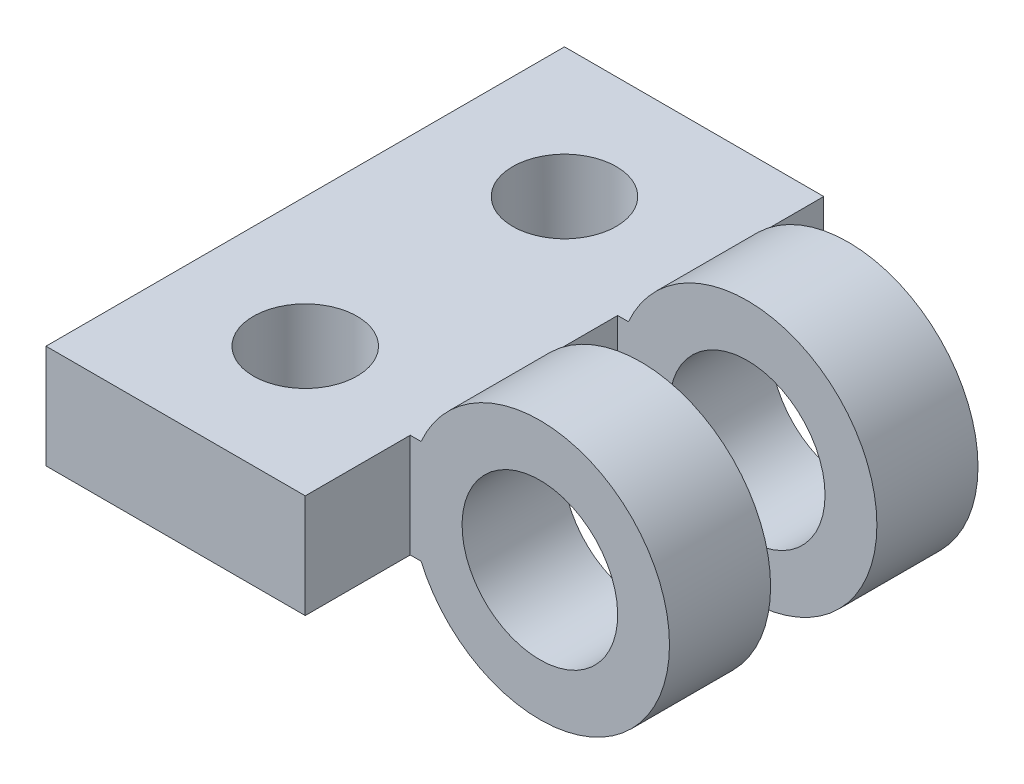
ISO-10303-21;
HEADER;
FILE_DESCRIPTION(('STEP AP214'),'2;1');
FILE_NAME('part.step','',(''),(''),'','','');
FILE_SCHEMA(('AUTOMOTIVE_DESIGN { 1 0 10303 214 1 1 1 1 }'));
ENDSEC;
DATA;
#1=APPLICATION_CONTEXT('core data for automotive mechanical design processes');
#2=APPLICATION_PROTOCOL_DEFINITION('international standard','automotive_design',2000,#1);
#3=PRODUCT_CONTEXT('',#1,'mechanical');
#4=PRODUCT('Part','Part','',(#3));
#5=PRODUCT_RELATED_PRODUCT_CATEGORY('part','',(#4));
#6=PRODUCT_DEFINITION_FORMATION('','',#4);
#7=PRODUCT_DEFINITION_CONTEXT('part definition',#1,'design');
#8=PRODUCT_DEFINITION('design','',#6,#7);
#9=PRODUCT_DEFINITION_SHAPE('','',#8);
#10=(LENGTH_UNIT() NAMED_UNIT(*) SI_UNIT(.MILLI.,.METRE.));
#11=(NAMED_UNIT(*) PLANE_ANGLE_UNIT() SI_UNIT($,.RADIAN.));
#12=(NAMED_UNIT(*) SI_UNIT($,.STERADIAN.) SOLID_ANGLE_UNIT());
#13=UNCERTAINTY_MEASURE_WITH_UNIT(LENGTH_MEASURE(1.E-05),#10,'distance_accuracy_value','');
#14=(GEOMETRIC_REPRESENTATION_CONTEXT(3) GLOBAL_UNCERTAINTY_ASSIGNED_CONTEXT((#13)) GLOBAL_UNIT_ASSIGNED_CONTEXT((#10,
#11,#12)) REPRESENTATION_CONTEXT('',''));
#15=CARTESIAN_POINT('',(0.,0.,0.));
#16=DIRECTION('',(0.,0.,1.));
#17=DIRECTION('',(1.,0.,0.));
#18=AXIS2_PLACEMENT_3D('',#15,#16,#17);
#19=CARTESIAN_POINT('',(-2.5,-1.,-2.025));
#20=DIRECTION('',(1.,0.,0.));
#21=DIRECTION('',(0.,0.,-1.));
#22=AXIS2_PLACEMENT_3D('',#19,#20,#21);
#23=PLANE('',#22);
#24=DIRECTION('',(0.,0.,-1.));
#25=VECTOR('',#24,1.);
#26=CARTESIAN_POINT('',(-2.5,1.,-2.025));
#27=LINE('',#26,#25);
#28=CARTESIAN_POINT('',(-2.5,1.,0.));
#29=VERTEX_POINT('',#28);
#30=CARTESIAN_POINT('',(-2.5,1.,-2.025));
#31=VERTEX_POINT('',#30);
#32=EDGE_CURVE('E251',#29,#31,#27,.T.);
#33=ORIENTED_EDGE('',*,*,#32,.F.);
#34=DIRECTION('',(0.,1.,0.));
#35=VECTOR('',#34,1.);
#36=CARTESIAN_POINT('',(-2.5,1.,0.));
#37=LINE('',#36,#35);
#38=CARTESIAN_POINT('',(-2.5,-1.,0.));
#39=VERTEX_POINT('',#38);
#40=EDGE_CURVE('E58',#39,#29,#37,.T.);
#41=ORIENTED_EDGE('',*,*,#40,.F.);
#42=DIRECTION('',(0.,0.,-1.));
#43=VECTOR('',#42,1.);
#44=CARTESIAN_POINT('',(-2.5,-1.,-2.025));
#45=LINE('',#44,#43);
#46=CARTESIAN_POINT('',(-2.5,-1.,-2.025));
#47=VERTEX_POINT('',#46);
#48=EDGE_CURVE('E282',#39,#47,#45,.T.);
#49=ORIENTED_EDGE('',*,*,#48,.T.);
#50=DIRECTION('',(0.,1.,0.));
#51=VECTOR('',#50,1.);
#52=CARTESIAN_POINT('',(-2.5,-1.,-2.025));
#53=LINE('',#52,#51);
#54=EDGE_CURVE('E172',#47,#31,#53,.T.);
#55=ORIENTED_EDGE('',*,*,#54,.T.);
#56=EDGE_LOOP('',(#33,#41,#49,#55));
#57=FACE_BOUND('',#56,.T.);
#58=ADVANCED_FACE('F42',(#57),#23,.T.);
#59=DIRECTION('',(0.,-1.,0.));
#60=VECTOR('',#59,1.);
#61=CARTESIAN_POINT('',(-2.5,1.,1.95));
#62=LINE('',#61,#60);
#63=CARTESIAN_POINT('',(-2.5,1.,1.95));
#64=VERTEX_POINT('',#63);
#65=CARTESIAN_POINT('',(-2.5,-1.,1.95));
#66=VERTEX_POINT('',#65);
#67=EDGE_CURVE('E160',#64,#66,#62,.T.);
#68=ORIENTED_EDGE('',*,*,#67,.F.);
#69=CARTESIAN_POINT('',(-2.5,1.,4.));
#70=VERTEX_POINT('',#69);
#71=EDGE_CURVE('E141',#70,#64,#27,.T.);
#72=ORIENTED_EDGE('',*,*,#71,.F.);
#73=DIRECTION('',(0.,1.,0.));
#74=VECTOR('',#73,1.);
#75=CARTESIAN_POINT('',(-2.5,1.,4.));
#76=LINE('',#75,#74);
#77=CARTESIAN_POINT('',(-2.5,-1.,4.));
#78=VERTEX_POINT('',#77);
#79=EDGE_CURVE('E66',#78,#70,#76,.T.);
#80=ORIENTED_EDGE('',*,*,#79,.F.);
#81=EDGE_CURVE('E280',#78,#66,#45,.T.);
#82=ORIENTED_EDGE('',*,*,#81,.T.);
#83=EDGE_LOOP('',(#68,#72,#80,#82));
#84=FACE_BOUND('',#83,.T.);
#85=ADVANCED_FACE('F204',(#84),#23,.T.);
#86=CARTESIAN_POINT('',(0.,0.,1.95));
#87=DIRECTION('',(0.,0.,-1.));
#88=DIRECTION('',(-1.,0.,0.));
#89=AXIS2_PLACEMENT_3D('',#86,#87,#88);
#90=CYLINDRICAL_SURFACE('',#89,2.5);
#91=DIRECTION('',(0.,0.,1.));
#92=VECTOR('',#91,1.);
#93=CARTESIAN_POINT('',(-2.29128784747792,1.,4.));
#94=LINE('',#93,#92);
#95=CARTESIAN_POINT('',(-2.29128784747792,1.,1.95));
#96=VERTEX_POINT('',#95);
#97=CARTESIAN_POINT('',(-2.29128784747792,1.,0.));
#98=VERTEX_POINT('',#97);
#99=EDGE_CURVE('E138',#96,#98,#94,.F.);
#100=ORIENTED_EDGE('',*,*,#99,.F.);
#101=CARTESIAN_POINT('',(0.,0.,1.95));
#102=DIRECTION('',(0.,0.,1.));
#103=DIRECTION('',(1.,0.,0.));
#104=AXIS2_PLACEMENT_3D('',#101,#102,#103);
#105=CIRCLE('',#104,2.5);
#106=CARTESIAN_POINT('',(-2.29128784747792,-1.,1.95));
#107=VERTEX_POINT('',#106);
#108=EDGE_CURVE('E11',#107,#96,#105,.T.);
#109=ORIENTED_EDGE('',*,*,#108,.F.);
#110=DIRECTION('',(0.,0.,1.));
#111=VECTOR('',#110,1.);
#112=CARTESIAN_POINT('',(-2.29128784747792,-1.,4.));
#113=LINE('',#112,#111);
#114=CARTESIAN_POINT('',(-2.29128784747792,-1.,0.));
#115=VERTEX_POINT('',#114);
#116=EDGE_CURVE('E164',#115,#107,#113,.T.);
#117=ORIENTED_EDGE('',*,*,#116,.F.);
#118=CARTESIAN_POINT('',(0.,0.,0.));
#119=DIRECTION('',(0.,0.,1.));
#120=DIRECTION('',(1.,0.,0.));
#121=AXIS2_PLACEMENT_3D('',#118,#119,#120);
#122=CIRCLE('',#121,2.5);
#123=EDGE_CURVE('E46',#115,#98,#122,.T.);
#124=ORIENTED_EDGE('',*,*,#123,.T.);
#125=EDGE_LOOP('',(#100,#109,#117,#124));
#126=FACE_BOUND('',#125,.T.);
#127=ADVANCED_FACE('F44',(#126),#90,.T.);
#128=DIRECTION('',(0.,-1.,0.));
#129=VECTOR('',#128,1.);
#130=CARTESIAN_POINT('',(-2.5,1.,5.95));
#131=LINE('',#130,#129);
#132=CARTESIAN_POINT('',(-2.5,1.,5.95));
#133=VERTEX_POINT('',#132);
#134=CARTESIAN_POINT('',(-2.5,-1.,5.95));
#135=VERTEX_POINT('',#134);
#136=EDGE_CURVE('E224',#133,#135,#131,.T.);
#137=ORIENTED_EDGE('',*,*,#136,.F.);
#138=CARTESIAN_POINT('',(-2.5,1.,7.975));
#139=VERTEX_POINT('',#138);
#140=EDGE_CURVE('E226',#139,#133,#27,.T.);
#141=ORIENTED_EDGE('',*,*,#140,.F.);
#142=DIRECTION('',(0.,1.,0.));
#143=VECTOR('',#142,1.);
#144=CARTESIAN_POINT('',(-2.5,-1.,7.975));
#145=LINE('',#144,#143);
#146=CARTESIAN_POINT('',(-2.5,-1.,7.975));
#147=VERTEX_POINT('',#146);
#148=EDGE_CURVE('E169',#147,#139,#145,.T.);
#149=ORIENTED_EDGE('',*,*,#148,.F.);
#150=EDGE_CURVE('E228',#147,#135,#45,.T.);
#151=ORIENTED_EDGE('',*,*,#150,.T.);
#152=EDGE_LOOP('',(#137,#141,#149,#151));
#153=FACE_BOUND('',#152,.T.);
#154=ADVANCED_FACE('F207',(#153),#23,.T.);
#155=CARTESIAN_POINT('',(0.,0.,4.));
#156=DIRECTION('',(0.,0.,1.));
#157=DIRECTION('',(0.,-1.,0.));
#158=AXIS2_PLACEMENT_3D('',#155,#156,#157);
#159=CYLINDRICAL_SURFACE('',#158,2.5);
#160=CARTESIAN_POINT('',(0.,0.,4.));
#161=DIRECTION('',(0.,0.,1.));
#162=DIRECTION('',(0.,-1.,0.));
#163=AXIS2_PLACEMENT_3D('',#160,#161,#162);
#164=CIRCLE('',#163,2.5);
#165=CARTESIAN_POINT('',(-2.29128784747792,-1.,4.));
#166=VERTEX_POINT('',#165);
#167=CARTESIAN_POINT('',(-2.29128784747792,1.,4.));
#168=VERTEX_POINT('',#167);
#169=EDGE_CURVE('E233',#166,#168,#164,.T.);
#170=ORIENTED_EDGE('',*,*,#169,.T.);
#171=DIRECTION('',(0.,0.,1.));
#172=VECTOR('',#171,1.);
#173=CARTESIAN_POINT('',(-2.29128784747792,1.,4.));
#174=LINE('',#173,#172);
#175=CARTESIAN_POINT('',(-2.29128784747792,0.999999999999999,5.95));
#176=VERTEX_POINT('',#175);
#177=EDGE_CURVE('E327',#176,#168,#174,.F.);
#178=ORIENTED_EDGE('',*,*,#177,.F.);
#179=CARTESIAN_POINT('',(0.,0.,5.95));
#180=DIRECTION('',(0.,0.,1.));
#181=DIRECTION('',(0.,-1.,0.));
#182=AXIS2_PLACEMENT_3D('',#179,#180,#181);
#183=CIRCLE('',#182,2.5);
#184=CARTESIAN_POINT('',(-2.29128784747792,-1.,5.95));
#185=VERTEX_POINT('',#184);
#186=EDGE_CURVE('E238',#185,#176,#183,.T.);
#187=ORIENTED_EDGE('',*,*,#186,.F.);
#188=DIRECTION('',(0.,0.,1.));
#189=VECTOR('',#188,1.);
#190=CARTESIAN_POINT('',(-2.29128784747792,-1.,4.));
#191=LINE('',#190,#189);
#192=EDGE_CURVE('E259',#166,#185,#191,.T.);
#193=ORIENTED_EDGE('',*,*,#192,.F.);
#194=EDGE_LOOP('',(#170,#178,#187,#193));
#195=FACE_BOUND('',#194,.T.);
#196=ADVANCED_FACE('F214',(#195),#159,.T.);
#197=CARTESIAN_POINT('',(0.,0.,1.95));
#198=DIRECTION('',(0.,0.,1.));
#199=DIRECTION('',(1.,0.,0.));
#200=AXIS2_PLACEMENT_3D('',#197,#198,#199);
#201=PLANE('',#200);
#202=ORIENTED_EDGE('',*,*,#108,.T.);
#203=DIRECTION('',(-1.,0.,0.));
#204=VECTOR('',#203,1.);
#205=CARTESIAN_POINT('',(2.501,1.,1.95));
#206=LINE('',#205,#204);
#207=EDGE_CURVE('E134',#96,#64,#206,.T.);
#208=ORIENTED_EDGE('',*,*,#207,.T.);
#209=ORIENTED_EDGE('',*,*,#67,.T.);
#210=DIRECTION('',(-1.,0.,0.));
#211=VECTOR('',#210,1.);
#212=CARTESIAN_POINT('',(2.501,-1.,1.95));
#213=LINE('',#212,#211);
#214=EDGE_CURVE('E159',#107,#66,#213,.T.);
#215=ORIENTED_EDGE('',*,*,#214,.F.);
#216=EDGE_LOOP('',(#202,#208,#209,#215));
#217=FACE_BOUND('',#216,.T.);
#218=CARTESIAN_POINT('',(0.,0.,1.95));
#219=DIRECTION('',(0.,0.,1.));
#220=DIRECTION('',(1.,0.,0.));
#221=AXIS2_PLACEMENT_3D('',#218,#219,#220);
#222=CIRCLE('',#221,1.5);
#223=CARTESIAN_POINT('',(1.5,0.,1.95));
#224=VERTEX_POINT('',#223);
#225=EDGE_CURVE('E180',#224,#224,#222,.T.);
#226=ORIENTED_EDGE('',*,*,#225,.F.);
#227=EDGE_LOOP('',(#226));
#228=FACE_BOUND('',#227,.T.);
#229=ADVANCED_FACE('F156',(#217,#228),#201,.T.);
#230=CARTESIAN_POINT('',(0.,0.,0.));
#231=DIRECTION('',(0.,0.,1.));
#232=DIRECTION('',(1.,0.,0.));
#233=AXIS2_PLACEMENT_3D('',#230,#231,#232);
#234=PLANE('',#233);
#235=ORIENTED_EDGE('',*,*,#123,.F.);
#236=DIRECTION('',(-1.,0.,0.));
#237=VECTOR('',#236,1.);
#238=CARTESIAN_POINT('',(2.501,-1.,0.));
#239=LINE('',#238,#237);
#240=EDGE_CURVE('E163',#115,#39,#239,.T.);
#241=ORIENTED_EDGE('',*,*,#240,.T.);
#242=ORIENTED_EDGE('',*,*,#40,.T.);
#243=DIRECTION('',(-1.,0.,0.));
#244=VECTOR('',#243,1.);
#245=CARTESIAN_POINT('',(2.501,1.,0.));
#246=LINE('',#245,#244);
#247=EDGE_CURVE('E146',#98,#29,#246,.T.);
#248=ORIENTED_EDGE('',*,*,#247,.F.);
#249=EDGE_LOOP('',(#235,#241,#242,#248));
#250=FACE_BOUND('',#249,.T.);
#251=CARTESIAN_POINT('',(0.,0.,0.));
#252=DIRECTION('',(0.,0.,1.));
#253=DIRECTION('',(1.,0.,0.));
#254=AXIS2_PLACEMENT_3D('',#251,#252,#253);
#255=CIRCLE('',#254,1.5);
#256=CARTESIAN_POINT('',(1.5,0.,0.));
#257=VERTEX_POINT('',#256);
#258=EDGE_CURVE('E178',#257,#257,#255,.T.);
#259=ORIENTED_EDGE('',*,*,#258,.T.);
#260=EDGE_LOOP('',(#259));
#261=FACE_BOUND('',#260,.T.);
#262=ADVANCED_FACE('F188',(#250,#261),#234,.F.);
#263=CARTESIAN_POINT('',(0.,0.,1.95));
#264=DIRECTION('',(0.,0.,-1.));
#265=DIRECTION('',(-1.,0.,0.));
#266=AXIS2_PLACEMENT_3D('',#263,#264,#265);
#267=CYLINDRICAL_SURFACE('',#266,1.5);
#268=ORIENTED_EDGE('',*,*,#225,.T.);
#269=EDGE_LOOP('',(#268));
#270=FACE_BOUND('',#269,.T.);
#271=ORIENTED_EDGE('',*,*,#258,.F.);
#272=EDGE_LOOP('',(#271));
#273=FACE_BOUND('',#272,.T.);
#274=ADVANCED_FACE('F190',(#270,#273),#267,.F.);
#275=CARTESIAN_POINT('',(2.501,-1.,1.95));
#276=DIRECTION('',(0.,1.,0.));
#277=DIRECTION('',(0.,0.,1.));
#278=AXIS2_PLACEMENT_3D('',#275,#276,#277);
#279=PLANE('',#278);
#280=CARTESIAN_POINT('',(-5.,-1.,5.475));
#281=DIRECTION('',(0.,1.,0.));
#282=DIRECTION('',(0.,0.,1.));
#283=AXIS2_PLACEMENT_3D('',#280,#281,#282);
#284=CIRCLE('',#283,1.);
#285=CARTESIAN_POINT('',(-5.,-1.,6.475));
#286=VERTEX_POINT('',#285);
#287=EDGE_CURVE('E153',#286,#286,#284,.T.);
#288=ORIENTED_EDGE('',*,*,#287,.T.);
#289=EDGE_LOOP('',(#288));
#290=FACE_BOUND('',#289,.T.);
#291=CARTESIAN_POINT('',(-5.,-1.,0.475));
#292=DIRECTION('',(0.,1.,0.));
#293=DIRECTION('',(0.,0.,1.));
#294=AXIS2_PLACEMENT_3D('',#291,#292,#293);
#295=CIRCLE('',#294,1.);
#296=CARTESIAN_POINT('',(-5.,-1.,1.475));
#297=VERTEX_POINT('',#296);
#298=EDGE_CURVE('E550',#297,#297,#295,.T.);
#299=ORIENTED_EDGE('',*,*,#298,.T.);
#300=EDGE_LOOP('',(#299));
#301=FACE_BOUND('',#300,.T.);
#302=ORIENTED_EDGE('',*,*,#240,.F.);
#303=ORIENTED_EDGE('',*,*,#116,.T.);
#304=ORIENTED_EDGE('',*,*,#214,.T.);
#305=ORIENTED_EDGE('',*,*,#81,.F.);
#306=DIRECTION('',(-1.,0.,0.));
#307=VECTOR('',#306,1.);
#308=CARTESIAN_POINT('',(2.501,-1.,4.));
#309=LINE('',#308,#307);
#310=EDGE_CURVE('E267',#166,#78,#309,.T.);
#311=ORIENTED_EDGE('',*,*,#310,.F.);
#312=ORIENTED_EDGE('',*,*,#192,.T.);
#313=DIRECTION('',(-1.,0.,0.));
#314=VECTOR('',#313,1.);
#315=CARTESIAN_POINT('',(2.501,-1.,5.95));
#316=LINE('',#315,#314);
#317=EDGE_CURVE('E263',#185,#135,#316,.T.);
#318=ORIENTED_EDGE('',*,*,#317,.T.);
#319=ORIENTED_EDGE('',*,*,#150,.F.);
#320=DIRECTION('',(1.,0.,0.));
#321=VECTOR('',#320,1.);
#322=CARTESIAN_POINT('',(-2.5,-1.,7.975));
#323=LINE('',#322,#321);
#324=CARTESIAN_POINT('',(-7.5,-1.,7.975));
#325=VERTEX_POINT('',#324);
#326=EDGE_CURVE('E297',#325,#147,#323,.T.);
#327=ORIENTED_EDGE('',*,*,#326,.F.);
#328=DIRECTION('',(0.,0.,1.));
#329=VECTOR('',#328,1.);
#330=CARTESIAN_POINT('',(-7.5,-1.,-2.025));
#331=LINE('',#330,#329);
#332=CARTESIAN_POINT('',(-7.5,-1.,-2.025));
#333=VERTEX_POINT('',#332);
#334=EDGE_CURVE('E293',#333,#325,#331,.T.);
#335=ORIENTED_EDGE('',*,*,#334,.F.);
#336=DIRECTION('',(-1.,0.,0.));
#337=VECTOR('',#336,1.);
#338=CARTESIAN_POINT('',(-2.5,-1.,-2.025));
#339=LINE('',#338,#337);
#340=EDGE_CURVE('E286',#47,#333,#339,.T.);
#341=ORIENTED_EDGE('',*,*,#340,.F.);
#342=ORIENTED_EDGE('',*,*,#48,.F.);
#343=EDGE_LOOP('',(#302,#303,#304,#305,#311,#312,#318,#319,#327,#335,#341,#342));
#344=FACE_BOUND('',#343,.T.);
#345=ADVANCED_FACE('F192',(#290,#301,#344),#279,.F.);
#346=CARTESIAN_POINT('',(-2.5,-1.,7.975));
#347=DIRECTION('',(0.,0.,1.));
#348=DIRECTION('',(1.,0.,0.));
#349=AXIS2_PLACEMENT_3D('',#346,#347,#348);
#350=PLANE('',#349);
#351=ORIENTED_EDGE('',*,*,#148,.T.);
#352=DIRECTION('',(1.,0.,0.));
#353=VECTOR('',#352,1.);
#354=CARTESIAN_POINT('',(-2.5,1.,7.975));
#355=LINE('',#354,#353);
#356=CARTESIAN_POINT('',(-7.5,1.,7.975));
#357=VERTEX_POINT('',#356);
#358=EDGE_CURVE('E247',#357,#139,#355,.T.);
#359=ORIENTED_EDGE('',*,*,#358,.F.);
#360=DIRECTION('',(0.,1.,0.));
#361=VECTOR('',#360,1.);
#362=CARTESIAN_POINT('',(-7.5,-1.,7.975));
#363=LINE('',#362,#361);
#364=EDGE_CURVE('E303',#325,#357,#363,.T.);
#365=ORIENTED_EDGE('',*,*,#364,.F.);
#366=ORIENTED_EDGE('',*,*,#326,.T.);
#367=EDGE_LOOP('',(#351,#359,#365,#366));
#368=FACE_BOUND('',#367,.T.);
#369=ADVANCED_FACE('F199',(#368),#350,.T.);
#370=CARTESIAN_POINT('',(-7.5,-1.,-2.025));
#371=DIRECTION('',(-1.,0.,0.));
#372=DIRECTION('',(0.,0.,1.));
#373=AXIS2_PLACEMENT_3D('',#370,#371,#372);
#374=PLANE('',#373);
#375=ORIENTED_EDGE('',*,*,#364,.T.);
#376=DIRECTION('',(0.,0.,1.));
#377=VECTOR('',#376,1.);
#378=CARTESIAN_POINT('',(-7.5,1.,-2.025));
#379=LINE('',#378,#377);
#380=CARTESIAN_POINT('',(-7.5,1.,-2.025));
#381=VERTEX_POINT('',#380);
#382=EDGE_CURVE('E255',#381,#357,#379,.T.);
#383=ORIENTED_EDGE('',*,*,#382,.F.);
#384=DIRECTION('',(0.,1.,0.));
#385=VECTOR('',#384,1.);
#386=CARTESIAN_POINT('',(-7.5,-1.,-2.025));
#387=LINE('',#386,#385);
#388=EDGE_CURVE('E305',#333,#381,#387,.T.);
#389=ORIENTED_EDGE('',*,*,#388,.F.);
#390=ORIENTED_EDGE('',*,*,#334,.T.);
#391=EDGE_LOOP('',(#375,#383,#389,#390));
#392=FACE_BOUND('',#391,.T.);
#393=ADVANCED_FACE('F315',(#392),#374,.T.);
#394=CARTESIAN_POINT('',(-2.5,-1.,-2.025));
#395=DIRECTION('',(0.,0.,-1.));
#396=DIRECTION('',(-1.,0.,0.));
#397=AXIS2_PLACEMENT_3D('',#394,#395,#396);
#398=PLANE('',#397);
#399=ORIENTED_EDGE('',*,*,#388,.T.);
#400=DIRECTION('',(-1.,0.,0.));
#401=VECTOR('',#400,1.);
#402=CARTESIAN_POINT('',(-2.5,1.,-2.025));
#403=LINE('',#402,#401);
#404=EDGE_CURVE('E249',#31,#381,#403,.T.);
#405=ORIENTED_EDGE('',*,*,#404,.F.);
#406=ORIENTED_EDGE('',*,*,#54,.F.);
#407=ORIENTED_EDGE('',*,*,#340,.T.);
#408=EDGE_LOOP('',(#399,#405,#406,#407));
#409=FACE_BOUND('',#408,.T.);
#410=ADVANCED_FACE('F312',(#409),#398,.T.);
#411=CARTESIAN_POINT('',(0.,1.,0.));
#412=DIRECTION('',(0.,-1.,0.));
#413=DIRECTION('',(0.,0.,-1.));
#414=AXIS2_PLACEMENT_3D('',#411,#412,#413);
#415=PLANE('',#414);
#416=CARTESIAN_POINT('',(-5.,1.,5.475));
#417=DIRECTION('',(0.,1.,0.));
#418=DIRECTION('',(0.,0.,1.));
#419=AXIS2_PLACEMENT_3D('',#416,#417,#418);
#420=CIRCLE('',#419,1.);
#421=CARTESIAN_POINT('',(-5.,1.,6.475));
#422=VERTEX_POINT('',#421);
#423=EDGE_CURVE('E546',#422,#422,#420,.T.);
#424=ORIENTED_EDGE('',*,*,#423,.F.);
#425=EDGE_LOOP('',(#424));
#426=FACE_BOUND('',#425,.T.);
#427=CARTESIAN_POINT('',(-5.,1.,0.475));
#428=DIRECTION('',(0.,1.,0.));
#429=DIRECTION('',(0.,0.,-1.));
#430=AXIS2_PLACEMENT_3D('',#427,#428,#429);
#431=CIRCLE('',#430,1.);
#432=CARTESIAN_POINT('',(-5.,1.,-0.525));
#433=VERTEX_POINT('',#432);
#434=EDGE_CURVE('E555',#433,#433,#431,.T.);
#435=ORIENTED_EDGE('',*,*,#434,.F.);
#436=EDGE_LOOP('',(#435));
#437=FACE_BOUND('',#436,.T.);
#438=ORIENTED_EDGE('',*,*,#140,.T.);
#439=DIRECTION('',(-1.,0.,0.));
#440=VECTOR('',#439,1.);
#441=CARTESIAN_POINT('',(2.501,1.,5.95));
#442=LINE('',#441,#440);
#443=EDGE_CURVE('E145',#176,#133,#442,.T.);
#444=ORIENTED_EDGE('',*,*,#443,.F.);
#445=ORIENTED_EDGE('',*,*,#177,.T.);
#446=DIRECTION('',(-1.,0.,0.));
#447=VECTOR('',#446,1.);
#448=CARTESIAN_POINT('',(2.501,1.,4.));
#449=LINE('',#448,#447);
#450=EDGE_CURVE('E242',#168,#70,#449,.T.);
#451=ORIENTED_EDGE('',*,*,#450,.T.);
#452=ORIENTED_EDGE('',*,*,#71,.T.);
#453=ORIENTED_EDGE('',*,*,#207,.F.);
#454=ORIENTED_EDGE('',*,*,#99,.T.);
#455=ORIENTED_EDGE('',*,*,#247,.T.);
#456=ORIENTED_EDGE('',*,*,#32,.T.);
#457=ORIENTED_EDGE('',*,*,#404,.T.);
#458=ORIENTED_EDGE('',*,*,#382,.T.);
#459=ORIENTED_EDGE('',*,*,#358,.T.);
#460=EDGE_LOOP('',(#438,#444,#445,#451,#452,#453,#454,#455,#456,#457,#458,#459));
#461=FACE_BOUND('',#460,.T.);
#462=ADVANCED_FACE('F137',(#426,#437,#461),#415,.F.);
#463=CARTESIAN_POINT('',(2.501,1.,4.));
#464=DIRECTION('',(0.,0.,1.));
#465=DIRECTION('',(1.,0.,0.));
#466=AXIS2_PLACEMENT_3D('',#463,#464,#465);
#467=PLANE('',#466);
#468=ORIENTED_EDGE('',*,*,#79,.T.);
#469=ORIENTED_EDGE('',*,*,#450,.F.);
#470=ORIENTED_EDGE('',*,*,#169,.F.);
#471=ORIENTED_EDGE('',*,*,#310,.T.);
#472=EDGE_LOOP('',(#468,#469,#470,#471));
#473=FACE_BOUND('',#472,.T.);
#474=CARTESIAN_POINT('',(0.,0.,4.));
#475=DIRECTION('',(0.,0.,1.));
#476=DIRECTION('',(0.,-1.,0.));
#477=AXIS2_PLACEMENT_3D('',#474,#475,#476);
#478=CIRCLE('',#477,1.50060411017446);
#479=CARTESIAN_POINT('',(0.,-1.50060411017446,4.));
#480=VERTEX_POINT('',#479);
#481=EDGE_CURVE('E336',#480,#480,#478,.T.);
#482=ORIENTED_EDGE('',*,*,#481,.T.);
#483=EDGE_LOOP('',(#482));
#484=FACE_BOUND('',#483,.T.);
#485=ADVANCED_FACE('F277',(#473,#484),#467,.F.);
#486=CARTESIAN_POINT('',(2.501,1.,5.95));
#487=DIRECTION('',(0.,0.,-1.));
#488=DIRECTION('',(-1.,0.,0.));
#489=AXIS2_PLACEMENT_3D('',#486,#487,#488);
#490=PLANE('',#489);
#491=ORIENTED_EDGE('',*,*,#317,.F.);
#492=ORIENTED_EDGE('',*,*,#186,.T.);
#493=ORIENTED_EDGE('',*,*,#443,.T.);
#494=ORIENTED_EDGE('',*,*,#136,.T.);
#495=EDGE_LOOP('',(#491,#492,#493,#494));
#496=FACE_BOUND('',#495,.T.);
#497=CARTESIAN_POINT('',(0.,0.,5.95));
#498=DIRECTION('',(0.,0.,1.));
#499=DIRECTION('',(0.,-1.,0.));
#500=AXIS2_PLACEMENT_3D('',#497,#498,#499);
#501=CIRCLE('',#500,1.50060411017446);
#502=CARTESIAN_POINT('',(0.,-1.50060411017446,5.95));
#503=VERTEX_POINT('',#502);
#504=EDGE_CURVE('E331',#503,#503,#501,.T.);
#505=ORIENTED_EDGE('',*,*,#504,.F.);
#506=EDGE_LOOP('',(#505));
#507=FACE_BOUND('',#506,.T.);
#508=ADVANCED_FACE('F236',(#496,#507),#490,.F.);
#509=CARTESIAN_POINT('',(0.,0.,4.));
#510=DIRECTION('',(0.,0.,1.));
#511=DIRECTION('',(0.,-1.,0.));
#512=AXIS2_PLACEMENT_3D('',#509,#510,#511);
#513=CYLINDRICAL_SURFACE('',#512,1.50060411017446);
#514=ORIENTED_EDGE('',*,*,#481,.F.);
#515=EDGE_LOOP('',(#514));
#516=FACE_BOUND('',#515,.T.);
#517=ORIENTED_EDGE('',*,*,#504,.T.);
#518=EDGE_LOOP('',(#517));
#519=FACE_BOUND('',#518,.T.);
#520=ADVANCED_FACE('F342',(#516,#519),#513,.F.);
#521=CARTESIAN_POINT('',(-5.,-9.,0.475));
#522=DIRECTION('',(0.,1.,0.));
#523=DIRECTION('',(0.,0.,1.));
#524=AXIS2_PLACEMENT_3D('',#521,#522,#523);
#525=CYLINDRICAL_SURFACE('',#524,1.);
#526=ORIENTED_EDGE('',*,*,#434,.T.);
#527=EDGE_LOOP('',(#526));
#528=FACE_BOUND('',#527,.T.);
#529=ORIENTED_EDGE('',*,*,#298,.F.);
#530=EDGE_LOOP('',(#529));
#531=FACE_BOUND('',#530,.T.);
#532=ADVANCED_FACE('F345',(#528,#531),#525,.F.);
#533=CARTESIAN_POINT('',(-5.,-9.,5.475));
#534=DIRECTION('',(0.,1.,0.));
#535=DIRECTION('',(0.,0.,1.));
#536=AXIS2_PLACEMENT_3D('',#533,#534,#535);
#537=CYLINDRICAL_SURFACE('',#536,1.);
#538=ORIENTED_EDGE('',*,*,#423,.T.);
#539=EDGE_LOOP('',(#538));
#540=FACE_BOUND('',#539,.T.);
#541=ORIENTED_EDGE('',*,*,#287,.F.);
#542=EDGE_LOOP('',(#541));
#543=FACE_BOUND('',#542,.T.);
#544=ADVANCED_FACE('F416',(#540,#543),#537,.F.);
#545=CLOSED_SHELL('',(#58,#85,#127,#154,#196,#229,#262,#274,#345,#369,#393,#410,#462,#485,#508,
#520,#532,#544));
#546=MANIFOLD_SOLID_BREP('B2',#545);
#547=ADVANCED_BREP_SHAPE_REPRESENTATION('',(#18,#546),#14);
#548=SHAPE_DEFINITION_REPRESENTATION(#9,#547);
ENDSEC;
END-ISO-10303-21;
